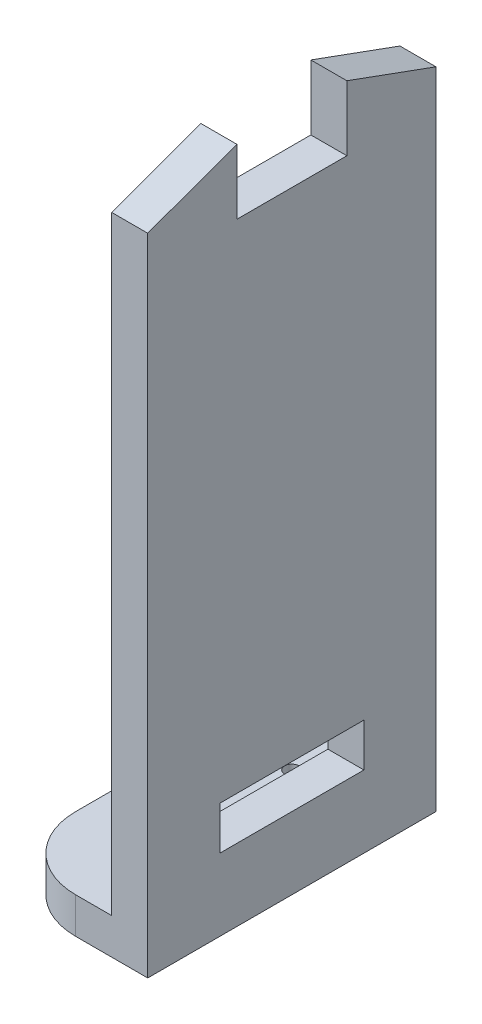
ISO-10303-21;
HEADER;
FILE_DESCRIPTION(('STEP AP214'),'2;1');
FILE_NAME('part.step','',(''),(''),'','','');
FILE_SCHEMA(('AUTOMOTIVE_DESIGN { 1 0 10303 214 1 1 1 1 }'));
ENDSEC;
DATA;
#1=APPLICATION_CONTEXT('core data for automotive mechanical design processes');
#2=APPLICATION_PROTOCOL_DEFINITION('international standard','automotive_design',2000,#1);
#3=PRODUCT_CONTEXT('',#1,'mechanical');
#4=PRODUCT('Part','Part','',(#3));
#5=PRODUCT_RELATED_PRODUCT_CATEGORY('part','',(#4));
#6=PRODUCT_DEFINITION_FORMATION('','',#4);
#7=PRODUCT_DEFINITION_CONTEXT('part definition',#1,'design');
#8=PRODUCT_DEFINITION('design','',#6,#7);
#9=PRODUCT_DEFINITION_SHAPE('','',#8);
#10=(LENGTH_UNIT() NAMED_UNIT(*) SI_UNIT(.MILLI.,.METRE.));
#11=(NAMED_UNIT(*) PLANE_ANGLE_UNIT() SI_UNIT($,.RADIAN.));
#12=(NAMED_UNIT(*) SI_UNIT($,.STERADIAN.) SOLID_ANGLE_UNIT());
#13=UNCERTAINTY_MEASURE_WITH_UNIT(LENGTH_MEASURE(1.E-05),#10,'distance_accuracy_value','');
#14=(GEOMETRIC_REPRESENTATION_CONTEXT(3) GLOBAL_UNCERTAINTY_ASSIGNED_CONTEXT((#13)) GLOBAL_UNIT_ASSIGNED_CONTEXT((#10,
#11,#12)) REPRESENTATION_CONTEXT('',''));
#15=CARTESIAN_POINT('',(0.,0.,0.));
#16=DIRECTION('',(0.,0.,1.));
#17=DIRECTION('',(1.,0.,0.));
#18=AXIS2_PLACEMENT_3D('',#15,#16,#17);
#19=CARTESIAN_POINT('',(3.93641699992273,5.,8.02072626814005));
#20=DIRECTION('',(-1.,0.,0.));
#21=DIRECTION('',(0.,0.,1.));
#22=AXIS2_PLACEMENT_3D('',#19,#20,#21);
#23=PLANE('',#22);
#24=DIRECTION('',(0.,0.,-1.));
#25=VECTOR('',#24,1.);
#26=CARTESIAN_POINT('',(3.93641699992273,0.,8.02072626814005));
#27=LINE('',#26,#25);
#28=CARTESIAN_POINT('',(3.93641699992273,0.,8.02072626814005));
#29=VERTEX_POINT('',#28);
#30=CARTESIAN_POINT('',(3.93641699992275,0.,-31.97927373186));
#31=VERTEX_POINT('',#30);
#32=EDGE_CURVE('E269',#29,#31,#27,.T.);
#33=ORIENTED_EDGE('',*,*,#32,.T.);
#34=DIRECTION('',(0.,-1.,0.));
#35=VECTOR('',#34,1.);
#36=CARTESIAN_POINT('',(3.93641699992275,5.,-31.97927373186));
#37=LINE('',#36,#35);
#38=CARTESIAN_POINT('',(3.93641699992275,89.5077910597415,-31.97927373186));
#39=VERTEX_POINT('',#38);
#40=EDGE_CURVE('E284',#39,#31,#37,.T.);
#41=ORIENTED_EDGE('',*,*,#40,.F.);
#42=DIRECTION('',(0.,0.342471678133721,0.939528152678925));
#43=VECTOR('',#42,1.);
#44=CARTESIAN_POINT('',(3.93641699992275,89.5077910597415,-31.97927373186));
#45=LINE('',#44,#43);
#46=CARTESIAN_POINT('',(3.93641699992274,94.015582119483,-19.6127135827085));
#47=VERTEX_POINT('',#46);
#48=EDGE_CURVE('E182',#39,#47,#45,.T.);
#49=ORIENTED_EDGE('',*,*,#48,.T.);
#50=DIRECTION('',(0.,-1.,0.));
#51=VECTOR('',#50,1.);
#52=CARTESIAN_POINT('',(3.93641699992274,94.015582119483,-19.6127135827085));
#53=LINE('',#52,#51);
#54=CARTESIAN_POINT('',(3.93641699992274,85.,-19.6127135827085));
#55=VERTEX_POINT('',#54);
#56=EDGE_CURVE('E214',#47,#55,#53,.T.);
#57=ORIENTED_EDGE('',*,*,#56,.T.);
#58=DIRECTION('',(0.,0.,1.));
#59=VECTOR('',#58,1.);
#60=CARTESIAN_POINT('',(3.93641699992274,85.,-19.6127135827085));
#61=LINE('',#60,#59);
#62=CARTESIAN_POINT('',(3.93641699992274,85.,-4.34583388101135));
#63=VERTEX_POINT('',#62);
#64=EDGE_CURVE('E217',#55,#63,#61,.T.);
#65=ORIENTED_EDGE('',*,*,#64,.T.);
#66=DIRECTION('',(0.,1.,0.));
#67=VECTOR('',#66,1.);
#68=CARTESIAN_POINT('',(3.93641699992274,85.,-4.34583388101135));
#69=LINE('',#68,#67);
#70=CARTESIAN_POINT('',(3.93641699992274,94.015582119483,-4.34583388101135));
#71=VERTEX_POINT('',#70);
#72=EDGE_CURVE('E220',#63,#71,#69,.T.);
#73=ORIENTED_EDGE('',*,*,#72,.T.);
#74=DIRECTION('',(0.,-0.342471678133721,0.939528152678925));
#75=VECTOR('',#74,1.);
#76=CARTESIAN_POINT('',(3.93641699992274,94.015582119483,-4.34583388101135));
#77=LINE('',#76,#75);
#78=CARTESIAN_POINT('',(3.93641699992273,89.5077910597415,8.02072626814005));
#79=VERTEX_POINT('',#78);
#80=EDGE_CURVE('E190',#71,#79,#77,.T.);
#81=ORIENTED_EDGE('',*,*,#80,.T.);
#82=DIRECTION('',(0.,-1.,0.));
#83=VECTOR('',#82,1.);
#84=CARTESIAN_POINT('',(3.93641699992273,5.,8.02072626814005));
#85=LINE('',#84,#83);
#86=EDGE_CURVE('E45',#79,#29,#85,.T.);
#87=ORIENTED_EDGE('',*,*,#86,.T.);
#88=EDGE_LOOP('',(#33,#41,#49,#57,#65,#73,#81,#87));
#89=FACE_BOUND('',#88,.T.);
#90=DIRECTION('',(0.,0.,1.));
#91=VECTOR('',#90,1.);
#92=CARTESIAN_POINT('',(3.93641699992274,16.,0.));
#93=LINE('',#92,#91);
#94=CARTESIAN_POINT('',(3.93641699992274,16.,-21.9792737318599));
#95=VERTEX_POINT('',#94);
#96=CARTESIAN_POINT('',(3.93641699992274,16.,-1.97927373186003));
#97=VERTEX_POINT('',#96);
#98=EDGE_CURVE('E153',#95,#97,#93,.T.);
#99=ORIENTED_EDGE('',*,*,#98,.F.);
#100=DIRECTION('',(0.,-1.,0.));
#101=VECTOR('',#100,1.);
#102=CARTESIAN_POINT('',(3.93641699992274,0.,-21.9792737318599));
#103=LINE('',#102,#101);
#104=CARTESIAN_POINT('',(3.93641699992274,10.,-21.9792737318599));
#105=VERTEX_POINT('',#104);
#106=EDGE_CURVE('E162',#95,#105,#103,.T.);
#107=ORIENTED_EDGE('',*,*,#106,.T.);
#108=DIRECTION('',(0.,0.,1.));
#109=VECTOR('',#108,1.);
#110=CARTESIAN_POINT('',(3.93641699992274,10.,0.));
#111=LINE('',#110,#109);
#112=CARTESIAN_POINT('',(3.93641699992274,10.,-1.97927373186003));
#113=VERTEX_POINT('',#112);
#114=EDGE_CURVE('E52',#105,#113,#111,.T.);
#115=ORIENTED_EDGE('',*,*,#114,.T.);
#116=DIRECTION('',(0.,-1.,0.));
#117=VECTOR('',#116,1.);
#118=CARTESIAN_POINT('',(3.93641699992274,0.,-1.97927373186003));
#119=LINE('',#118,#117);
#120=EDGE_CURVE('E159',#97,#113,#119,.T.);
#121=ORIENTED_EDGE('',*,*,#120,.F.);
#122=EDGE_LOOP('',(#99,#107,#115,#121));
#123=FACE_BOUND('',#122,.T.);
#124=ADVANCED_FACE('F37',(#89,#123),#23,.F.);
#125=CARTESIAN_POINT('',(-1.06358300007726,0.,0.));
#126=DIRECTION('',(1.,0.,0.));
#127=DIRECTION('',(0.,0.,-1.));
#128=AXIS2_PLACEMENT_3D('',#125,#126,#127);
#129=PLANE('',#128);
#130=DIRECTION('',(0.,-1.,0.));
#131=VECTOR('',#130,1.);
#132=CARTESIAN_POINT('',(-1.06358300007727,89.5077910597415,8.02072626814005));
#133=LINE('',#132,#131);
#134=CARTESIAN_POINT('',(-1.06358300007727,89.5077910597415,8.02072626814005));
#135=VERTEX_POINT('',#134);
#136=CARTESIAN_POINT('',(-1.06358300007727,5.,8.02072626814005));
#137=VERTEX_POINT('',#136);
#138=EDGE_CURVE('E186',#135,#137,#133,.T.);
#139=ORIENTED_EDGE('',*,*,#138,.F.);
#140=DIRECTION('',(0.,-0.342471678133721,0.939528152678925));
#141=VECTOR('',#140,1.);
#142=CARTESIAN_POINT('',(-1.06358300007726,94.015582119483,-4.34583388101135));
#143=LINE('',#142,#141);
#144=CARTESIAN_POINT('',(-1.06358300007726,94.015582119483,-4.34583388101135));
#145=VERTEX_POINT('',#144);
#146=EDGE_CURVE('E208',#145,#135,#143,.T.);
#147=ORIENTED_EDGE('',*,*,#146,.F.);
#148=DIRECTION('',(0.,1.,0.));
#149=VECTOR('',#148,1.);
#150=CARTESIAN_POINT('',(-1.06358300007726,85.,-4.34583388101135));
#151=LINE('',#150,#149);
#152=CARTESIAN_POINT('',(-1.06358300007726,85.,-4.34583388101135));
#153=VERTEX_POINT('',#152);
#154=EDGE_CURVE('E205',#153,#145,#151,.T.);
#155=ORIENTED_EDGE('',*,*,#154,.F.);
#156=DIRECTION('',(0.,0.,1.));
#157=VECTOR('',#156,1.);
#158=CARTESIAN_POINT('',(-1.06358300007726,85.,-19.6127135827085));
#159=LINE('',#158,#157);
#160=CARTESIAN_POINT('',(-1.06358300007726,85.,-19.6127135827085));
#161=VERTEX_POINT('',#160);
#162=EDGE_CURVE('E202',#161,#153,#159,.T.);
#163=ORIENTED_EDGE('',*,*,#162,.F.);
#164=DIRECTION('',(0.,-1.,0.));
#165=VECTOR('',#164,1.);
#166=CARTESIAN_POINT('',(-1.06358300007726,94.015582119483,-19.6127135827085));
#167=LINE('',#166,#165);
#168=CARTESIAN_POINT('',(-1.06358300007726,94.015582119483,-19.6127135827085));
#169=VERTEX_POINT('',#168);
#170=EDGE_CURVE('E199',#169,#161,#167,.T.);
#171=ORIENTED_EDGE('',*,*,#170,.F.);
#172=DIRECTION('',(0.,0.342471678133721,0.939528152678925));
#173=VECTOR('',#172,1.);
#174=CARTESIAN_POINT('',(-1.06358300007725,89.5077910597415,-31.97927373186));
#175=LINE('',#174,#173);
#176=CARTESIAN_POINT('',(-1.06358300007725,89.5077910597415,-31.97927373186));
#177=VERTEX_POINT('',#176);
#178=EDGE_CURVE('E196',#177,#169,#175,.T.);
#179=ORIENTED_EDGE('',*,*,#178,.F.);
#180=DIRECTION('',(0.,1.,0.));
#181=VECTOR('',#180,1.);
#182=CARTESIAN_POINT('',(-1.06358300007725,5.,-31.97927373186));
#183=LINE('',#182,#181);
#184=CARTESIAN_POINT('',(-1.06358300007726,5.,-31.97927373186));
#185=VERTEX_POINT('',#184);
#186=EDGE_CURVE('E193',#185,#177,#183,.T.);
#187=ORIENTED_EDGE('',*,*,#186,.F.);
#188=DIRECTION('',(0.,0.,-1.));
#189=VECTOR('',#188,1.);
#190=CARTESIAN_POINT('',(-1.06358300007727,5.,8.02072626814005));
#191=LINE('',#190,#189);
#192=EDGE_CURVE('E189',#137,#185,#191,.T.);
#193=ORIENTED_EDGE('',*,*,#192,.F.);
#194=EDGE_LOOP('',(#139,#147,#155,#163,#171,#179,#187,#193));
#195=FACE_BOUND('',#194,.T.);
#196=DIRECTION('',(0.,0.,1.));
#197=VECTOR('',#196,1.);
#198=CARTESIAN_POINT('',(-1.06358300007726,16.,0.));
#199=LINE('',#198,#197);
#200=CARTESIAN_POINT('',(-1.06358300007726,16.,-21.9792737318599));
#201=VERTEX_POINT('',#200);
#202=CARTESIAN_POINT('',(-1.06358300007726,16.,-1.97927373186003));
#203=VERTEX_POINT('',#202);
#204=EDGE_CURVE('E60',#201,#203,#199,.T.);
#205=ORIENTED_EDGE('',*,*,#204,.T.);
#206=DIRECTION('',(0.,-1.,0.));
#207=VECTOR('',#206,1.);
#208=CARTESIAN_POINT('',(-1.06358300007726,0.,-1.97927373186003));
#209=LINE('',#208,#207);
#210=CARTESIAN_POINT('',(-1.06358300007726,10.,-1.97927373186003));
#211=VERTEX_POINT('',#210);
#212=EDGE_CURVE('E167',#203,#211,#209,.T.);
#213=ORIENTED_EDGE('',*,*,#212,.T.);
#214=DIRECTION('',(0.,0.,1.));
#215=VECTOR('',#214,1.);
#216=CARTESIAN_POINT('',(-1.06358300007726,10.,0.));
#217=LINE('',#216,#215);
#218=CARTESIAN_POINT('',(-1.06358300007726,10.,-21.9792737318599));
#219=VERTEX_POINT('',#218);
#220=EDGE_CURVE('E170',#219,#211,#217,.T.);
#221=ORIENTED_EDGE('',*,*,#220,.F.);
#222=DIRECTION('',(0.,-1.,0.));
#223=VECTOR('',#222,1.);
#224=CARTESIAN_POINT('',(-1.06358300007726,0.,-21.9792737318599));
#225=LINE('',#224,#223);
#226=EDGE_CURVE('E176',#201,#219,#225,.T.);
#227=ORIENTED_EDGE('',*,*,#226,.F.);
#228=EDGE_LOOP('',(#205,#213,#221,#227));
#229=FACE_BOUND('',#228,.T.);
#230=ADVANCED_FACE('F314',(#195,#229),#129,.F.);
#231=CARTESIAN_POINT('',(-6.06358300007726,5.,-1.97927373185994));
#232=DIRECTION('',(0.,1.,0.));
#233=DIRECTION('',(0.,0.,1.));
#234=AXIS2_PLACEMENT_3D('',#231,#232,#233);
#235=PLANE('',#234);
#236=CARTESIAN_POINT('',(-6.06358300007726,5.,-21.9792737318599));
#237=DIRECTION('',(0.,1.,0.));
#238=DIRECTION('',(0.,0.,1.));
#239=AXIS2_PLACEMENT_3D('',#236,#237,#238);
#240=CIRCLE('',#239,1.);
#241=CARTESIAN_POINT('',(-6.06358300007726,5.,-20.9792737318599));
#242=VERTEX_POINT('',#241);
#243=EDGE_CURVE('E245',#242,#242,#240,.T.);
#244=ORIENTED_EDGE('',*,*,#243,.F.);
#245=EDGE_LOOP('',(#244));
#246=FACE_BOUND('',#245,.T.);
#247=CARTESIAN_POINT('',(-6.06358300007726,5.,-1.97927373185994));
#248=DIRECTION('',(0.,1.,0.));
#249=DIRECTION('',(0.,0.,1.));
#250=AXIS2_PLACEMENT_3D('',#247,#248,#249);
#251=CIRCLE('',#250,1.);
#252=CARTESIAN_POINT('',(-6.06358300007726,5.,-0.979273731859943));
#253=VERTEX_POINT('',#252);
#254=EDGE_CURVE('E239',#253,#253,#251,.T.);
#255=ORIENTED_EDGE('',*,*,#254,.F.);
#256=EDGE_LOOP('',(#255));
#257=FACE_BOUND('',#256,.T.);
#258=DIRECTION('',(1.,0.,0.));
#259=VECTOR('',#258,1.);
#260=CARTESIAN_POINT('',(-6.06358300007718,5.,8.02072626814005));
#261=LINE('',#260,#259);
#262=CARTESIAN_POINT('',(-6.06358300007718,5.,8.02072626814005));
#263=VERTEX_POINT('',#262);
#264=EDGE_CURVE('E254',#263,#137,#261,.T.);
#265=ORIENTED_EDGE('',*,*,#264,.T.);
#266=ORIENTED_EDGE('',*,*,#192,.T.);
#267=DIRECTION('',(-1.,0.,0.));
#268=VECTOR('',#267,1.);
#269=CARTESIAN_POINT('',(3.93641699992275,5.,-31.97927373186));
#270=LINE('',#269,#268);
#271=CARTESIAN_POINT('',(-6.06358300007718,5.,-31.97927373186));
#272=VERTEX_POINT('',#271);
#273=EDGE_CURVE('E258',#185,#272,#270,.T.);
#274=ORIENTED_EDGE('',*,*,#273,.T.);
#275=CARTESIAN_POINT('',(-6.06358300007726,5.,-21.9792737318599));
#276=DIRECTION('',(0.,1.,0.));
#277=DIRECTION('',(0.,0.,1.));
#278=AXIS2_PLACEMENT_3D('',#275,#276,#277);
#279=CIRCLE('',#278,10.);
#280=CARTESIAN_POINT('',(-16.0635830000773,5.,-21.9792737318599));
#281=VERTEX_POINT('',#280);
#282=EDGE_CURVE('E260',#272,#281,#279,.T.);
#283=ORIENTED_EDGE('',*,*,#282,.T.);
#284=DIRECTION('',(0.,0.,1.));
#285=VECTOR('',#284,1.);
#286=CARTESIAN_POINT('',(-16.0635830000773,5.,-21.9792737318599));
#287=LINE('',#286,#285);
#288=CARTESIAN_POINT('',(-16.0635830000773,5.,-1.97927373186002));
#289=VERTEX_POINT('',#288);
#290=EDGE_CURVE('E262',#281,#289,#287,.T.);
#291=ORIENTED_EDGE('',*,*,#290,.T.);
#292=CARTESIAN_POINT('',(-6.06358300007726,5.,-1.97927373185994));
#293=DIRECTION('',(0.,1.,0.));
#294=DIRECTION('',(0.,0.,1.));
#295=AXIS2_PLACEMENT_3D('',#292,#293,#294);
#296=CIRCLE('',#295,10.);
#297=EDGE_CURVE('E251',#289,#263,#296,.T.);
#298=ORIENTED_EDGE('',*,*,#297,.T.);
#299=EDGE_LOOP('',(#265,#266,#274,#283,#291,#298));
#300=FACE_BOUND('',#299,.T.);
#301=ADVANCED_FACE('F308',(#246,#257,#300),#235,.T.);
#302=CARTESIAN_POINT('',(-6.06358300007726,0.,-1.97927373185994));
#303=DIRECTION('',(0.,1.,0.));
#304=DIRECTION('',(0.,0.,1.));
#305=AXIS2_PLACEMENT_3D('',#302,#303,#304);
#306=PLANE('',#305);
#307=CARTESIAN_POINT('',(-6.06358300007726,0.,-1.97927373185994));
#308=DIRECTION('',(0.,1.,0.));
#309=DIRECTION('',(0.,0.,1.));
#310=AXIS2_PLACEMENT_3D('',#307,#308,#309);
#311=CIRCLE('',#310,10.);
#312=CARTESIAN_POINT('',(-16.0635830000773,0.,-1.97927373186002));
#313=VERTEX_POINT('',#312);
#314=CARTESIAN_POINT('',(-6.06358300007718,0.,8.02072626814005));
#315=VERTEX_POINT('',#314);
#316=EDGE_CURVE('E248',#313,#315,#311,.T.);
#317=ORIENTED_EDGE('',*,*,#316,.F.);
#318=DIRECTION('',(0.,0.,1.));
#319=VECTOR('',#318,1.);
#320=CARTESIAN_POINT('',(-16.0635830000773,0.,-21.9792737318599));
#321=LINE('',#320,#319);
#322=CARTESIAN_POINT('',(-16.0635830000773,0.,-21.9792737318599));
#323=VERTEX_POINT('',#322);
#324=EDGE_CURVE('E255',#323,#313,#321,.T.);
#325=ORIENTED_EDGE('',*,*,#324,.F.);
#326=CARTESIAN_POINT('',(-6.06358300007726,0.,-21.9792737318599));
#327=DIRECTION('',(0.,1.,0.));
#328=DIRECTION('',(0.,0.,1.));
#329=AXIS2_PLACEMENT_3D('',#326,#327,#328);
#330=CIRCLE('',#329,10.);
#331=CARTESIAN_POINT('',(-6.06358300007718,0.,-31.97927373186));
#332=VERTEX_POINT('',#331);
#333=EDGE_CURVE('E273',#332,#323,#330,.T.);
#334=ORIENTED_EDGE('',*,*,#333,.F.);
#335=DIRECTION('',(-1.,0.,0.));
#336=VECTOR('',#335,1.);
#337=CARTESIAN_POINT('',(3.93641699992275,0.,-31.97927373186));
#338=LINE('',#337,#336);
#339=EDGE_CURVE('E271',#31,#332,#338,.T.);
#340=ORIENTED_EDGE('',*,*,#339,.F.);
#341=ORIENTED_EDGE('',*,*,#32,.F.);
#342=DIRECTION('',(1.,0.,0.));
#343=VECTOR('',#342,1.);
#344=CARTESIAN_POINT('',(-6.06358300007718,0.,8.02072626814005));
#345=LINE('',#344,#343);
#346=EDGE_CURVE('E267',#315,#29,#345,.T.);
#347=ORIENTED_EDGE('',*,*,#346,.F.);
#348=EDGE_LOOP('',(#317,#325,#334,#340,#341,#347));
#349=FACE_BOUND('',#348,.T.);
#350=CARTESIAN_POINT('',(-6.06358300007726,0.,-21.9792737318599));
#351=DIRECTION('',(0.,1.,0.));
#352=DIRECTION('',(0.,0.,1.));
#353=AXIS2_PLACEMENT_3D('',#350,#351,#352);
#354=CIRCLE('',#353,1.);
#355=CARTESIAN_POINT('',(-6.06358300007726,0.,-20.9792737318599));
#356=VERTEX_POINT('',#355);
#357=EDGE_CURVE('E242',#356,#356,#354,.T.);
#358=ORIENTED_EDGE('',*,*,#357,.T.);
#359=EDGE_LOOP('',(#358));
#360=FACE_BOUND('',#359,.T.);
#361=CARTESIAN_POINT('',(-6.06358300007726,0.,-1.97927373185994));
#362=DIRECTION('',(0.,1.,0.));
#363=DIRECTION('',(0.,0.,1.));
#364=AXIS2_PLACEMENT_3D('',#361,#362,#363);
#365=CIRCLE('',#364,1.);
#366=CARTESIAN_POINT('',(-6.06358300007726,0.,-0.979273731859943));
#367=VERTEX_POINT('',#366);
#368=EDGE_CURVE('E228',#367,#367,#365,.T.);
#369=ORIENTED_EDGE('',*,*,#368,.T.);
#370=EDGE_LOOP('',(#369));
#371=FACE_BOUND('',#370,.T.);
#372=ADVANCED_FACE('F294',(#349,#360,#371),#306,.F.);
#373=CARTESIAN_POINT('',(-6.06358300007726,5.,-1.97927373185994));
#374=DIRECTION('',(0.,-1.,0.));
#375=DIRECTION('',(0.,0.,-1.));
#376=AXIS2_PLACEMENT_3D('',#373,#374,#375);
#377=CYLINDRICAL_SURFACE('',#376,10.);
#378=ORIENTED_EDGE('',*,*,#316,.T.);
#379=DIRECTION('',(0.,-1.,0.));
#380=VECTOR('',#379,1.);
#381=CARTESIAN_POINT('',(-6.06358300007718,5.,8.02072626814005));
#382=LINE('',#381,#380);
#383=EDGE_CURVE('E11',#263,#315,#382,.T.);
#384=ORIENTED_EDGE('',*,*,#383,.F.);
#385=ORIENTED_EDGE('',*,*,#297,.F.);
#386=DIRECTION('',(0.,-1.,0.));
#387=VECTOR('',#386,1.);
#388=CARTESIAN_POINT('',(-16.0635830000773,5.,-1.97927373186002));
#389=LINE('',#388,#387);
#390=EDGE_CURVE('E264',#289,#313,#389,.T.);
#391=ORIENTED_EDGE('',*,*,#390,.T.);
#392=EDGE_LOOP('',(#378,#384,#385,#391));
#393=FACE_BOUND('',#392,.T.);
#394=ADVANCED_FACE('F39',(#393),#377,.T.);
#395=CARTESIAN_POINT('',(-6.06358300007718,5.,8.02072626814005));
#396=DIRECTION('',(0.,0.,-1.));
#397=DIRECTION('',(-1.,0.,0.));
#398=AXIS2_PLACEMENT_3D('',#395,#396,#397);
#399=PLANE('',#398);
#400=ORIENTED_EDGE('',*,*,#346,.T.);
#401=ORIENTED_EDGE('',*,*,#86,.F.);
#402=DIRECTION('',(1.,0.,0.));
#403=VECTOR('',#402,1.);
#404=CARTESIAN_POINT('',(-1.06358300007727,89.5077910597415,8.02072626814005));
#405=LINE('',#404,#403);
#406=EDGE_CURVE('E225',#135,#79,#405,.T.);
#407=ORIENTED_EDGE('',*,*,#406,.F.);
#408=ORIENTED_EDGE('',*,*,#138,.T.);
#409=ORIENTED_EDGE('',*,*,#264,.F.);
#410=ORIENTED_EDGE('',*,*,#383,.T.);
#411=EDGE_LOOP('',(#400,#401,#407,#408,#409,#410));
#412=FACE_BOUND('',#411,.T.);
#413=ADVANCED_FACE('F333',(#412),#399,.F.);
#414=CARTESIAN_POINT('',(3.93641699992275,5.,-31.97927373186));
#415=DIRECTION('',(0.,0.,1.));
#416=DIRECTION('',(1.,0.,0.));
#417=AXIS2_PLACEMENT_3D('',#414,#415,#416);
#418=PLANE('',#417);
#419=ORIENTED_EDGE('',*,*,#339,.T.);
#420=DIRECTION('',(0.,-1.,0.));
#421=VECTOR('',#420,1.);
#422=CARTESIAN_POINT('',(-6.06358300007718,5.,-31.97927373186));
#423=LINE('',#422,#421);
#424=EDGE_CURVE('E281',#272,#332,#423,.T.);
#425=ORIENTED_EDGE('',*,*,#424,.F.);
#426=ORIENTED_EDGE('',*,*,#273,.F.);
#427=ORIENTED_EDGE('',*,*,#186,.T.);
#428=DIRECTION('',(1.,0.,0.));
#429=VECTOR('',#428,1.);
#430=CARTESIAN_POINT('',(-1.06358300007725,89.5077910597415,-31.97927373186));
#431=LINE('',#430,#429);
#432=EDGE_CURVE('E211',#177,#39,#431,.T.);
#433=ORIENTED_EDGE('',*,*,#432,.T.);
#434=ORIENTED_EDGE('',*,*,#40,.T.);
#435=EDGE_LOOP('',(#419,#425,#426,#427,#433,#434));
#436=FACE_BOUND('',#435,.T.);
#437=ADVANCED_FACE('F300',(#436),#418,.F.);
#438=CARTESIAN_POINT('',(-6.06358300007726,5.,-21.9792737318599));
#439=DIRECTION('',(0.,-1.,0.));
#440=DIRECTION('',(0.,0.,-1.));
#441=AXIS2_PLACEMENT_3D('',#438,#439,#440);
#442=CYLINDRICAL_SURFACE('',#441,10.);
#443=ORIENTED_EDGE('',*,*,#333,.T.);
#444=DIRECTION('',(0.,-1.,0.));
#445=VECTOR('',#444,1.);
#446=CARTESIAN_POINT('',(-16.0635830000773,5.,-21.9792737318599));
#447=LINE('',#446,#445);
#448=EDGE_CURVE('E278',#281,#323,#447,.T.);
#449=ORIENTED_EDGE('',*,*,#448,.F.);
#450=ORIENTED_EDGE('',*,*,#282,.F.);
#451=ORIENTED_EDGE('',*,*,#424,.T.);
#452=EDGE_LOOP('',(#443,#449,#450,#451));
#453=FACE_BOUND('',#452,.T.);
#454=ADVANCED_FACE('F304',(#453),#442,.T.);
#455=CARTESIAN_POINT('',(-16.0635830000773,5.,-21.9792737318599));
#456=DIRECTION('',(1.,0.,0.));
#457=DIRECTION('',(0.,0.,-1.));
#458=AXIS2_PLACEMENT_3D('',#455,#456,#457);
#459=PLANE('',#458);
#460=ORIENTED_EDGE('',*,*,#324,.T.);
#461=ORIENTED_EDGE('',*,*,#390,.F.);
#462=ORIENTED_EDGE('',*,*,#290,.F.);
#463=ORIENTED_EDGE('',*,*,#448,.T.);
#464=EDGE_LOOP('',(#460,#461,#462,#463));
#465=FACE_BOUND('',#464,.T.);
#466=ADVANCED_FACE('F338',(#465),#459,.F.);
#467=CARTESIAN_POINT('',(-6.06358300007726,5.,-21.9792737318599));
#468=DIRECTION('',(0.,-1.,0.));
#469=DIRECTION('',(0.,0.,-1.));
#470=AXIS2_PLACEMENT_3D('',#467,#468,#469);
#471=CYLINDRICAL_SURFACE('',#470,1.);
#472=ORIENTED_EDGE('',*,*,#243,.T.);
#473=EDGE_LOOP('',(#472));
#474=FACE_BOUND('',#473,.T.);
#475=ORIENTED_EDGE('',*,*,#357,.F.);
#476=EDGE_LOOP('',(#475));
#477=FACE_BOUND('',#476,.T.);
#478=ADVANCED_FACE('F340',(#474,#477),#471,.F.);
#479=CARTESIAN_POINT('',(-6.06358300007726,5.,-1.97927373185994));
#480=DIRECTION('',(0.,-1.,0.));
#481=DIRECTION('',(0.,0.,-1.));
#482=AXIS2_PLACEMENT_3D('',#479,#480,#481);
#483=CYLINDRICAL_SURFACE('',#482,1.);
#484=ORIENTED_EDGE('',*,*,#254,.T.);
#485=EDGE_LOOP('',(#484));
#486=FACE_BOUND('',#485,.T.);
#487=ORIENTED_EDGE('',*,*,#368,.F.);
#488=EDGE_LOOP('',(#487));
#489=FACE_BOUND('',#488,.T.);
#490=ADVANCED_FACE('F346',(#486,#489),#483,.F.);
#491=CARTESIAN_POINT('',(-1.06358300007726,94.015582119483,-4.34583388101135));
#492=DIRECTION('',(0.,0.939528152678925,0.342471678133721));
#493=DIRECTION('',(0.,-0.342471678133721,0.939528152678925));
#494=AXIS2_PLACEMENT_3D('',#491,#492,#493);
#495=PLANE('',#494);
#496=ORIENTED_EDGE('',*,*,#80,.F.);
#497=DIRECTION('',(1.,0.,0.));
#498=VECTOR('',#497,1.);
#499=CARTESIAN_POINT('',(-1.06358300007726,94.015582119483,-4.34583388101135));
#500=LINE('',#499,#498);
#501=EDGE_CURVE('E229',#145,#71,#500,.T.);
#502=ORIENTED_EDGE('',*,*,#501,.F.);
#503=ORIENTED_EDGE('',*,*,#146,.T.);
#504=ORIENTED_EDGE('',*,*,#406,.T.);
#505=EDGE_LOOP('',(#496,#502,#503,#504));
#506=FACE_BOUND('',#505,.T.);
#507=ADVANCED_FACE('F331',(#506),#495,.T.);
#508=CARTESIAN_POINT('',(-1.06358300007726,85.,-4.34583388101135));
#509=DIRECTION('',(0.,0.,-1.));
#510=DIRECTION('',(-1.,0.,0.));
#511=AXIS2_PLACEMENT_3D('',#508,#509,#510);
#512=PLANE('',#511);
#513=ORIENTED_EDGE('',*,*,#72,.F.);
#514=DIRECTION('',(1.,0.,0.));
#515=VECTOR('',#514,1.);
#516=CARTESIAN_POINT('',(-1.06358300007726,85.,-4.34583388101135));
#517=LINE('',#516,#515);
#518=EDGE_CURVE('E231',#153,#63,#517,.T.);
#519=ORIENTED_EDGE('',*,*,#518,.F.);
#520=ORIENTED_EDGE('',*,*,#154,.T.);
#521=ORIENTED_EDGE('',*,*,#501,.T.);
#522=EDGE_LOOP('',(#513,#519,#520,#521));
#523=FACE_BOUND('',#522,.T.);
#524=ADVANCED_FACE('F329',(#523),#512,.T.);
#525=CARTESIAN_POINT('',(-1.06358300007726,85.,-19.6127135827085));
#526=DIRECTION('',(0.,1.,0.));
#527=DIRECTION('',(0.,0.,1.));
#528=AXIS2_PLACEMENT_3D('',#525,#526,#527);
#529=PLANE('',#528);
#530=ORIENTED_EDGE('',*,*,#64,.F.);
#531=DIRECTION('',(1.,0.,0.));
#532=VECTOR('',#531,1.);
#533=CARTESIAN_POINT('',(-1.06358300007726,85.,-19.6127135827085));
#534=LINE('',#533,#532);
#535=EDGE_CURVE('E233',#161,#55,#534,.T.);
#536=ORIENTED_EDGE('',*,*,#535,.F.);
#537=ORIENTED_EDGE('',*,*,#162,.T.);
#538=ORIENTED_EDGE('',*,*,#518,.T.);
#539=EDGE_LOOP('',(#530,#536,#537,#538));
#540=FACE_BOUND('',#539,.T.);
#541=ADVANCED_FACE('F325',(#540),#529,.T.);
#542=CARTESIAN_POINT('',(-1.06358300007726,94.015582119483,-19.6127135827085));
#543=DIRECTION('',(0.,0.,1.));
#544=DIRECTION('',(1.,0.,0.));
#545=AXIS2_PLACEMENT_3D('',#542,#543,#544);
#546=PLANE('',#545);
#547=ORIENTED_EDGE('',*,*,#56,.F.);
#548=DIRECTION('',(1.,0.,0.));
#549=VECTOR('',#548,1.);
#550=CARTESIAN_POINT('',(-1.06358300007726,94.015582119483,-19.6127135827085));
#551=LINE('',#550,#549);
#552=EDGE_CURVE('E235',#169,#47,#551,.T.);
#553=ORIENTED_EDGE('',*,*,#552,.F.);
#554=ORIENTED_EDGE('',*,*,#170,.T.);
#555=ORIENTED_EDGE('',*,*,#535,.T.);
#556=EDGE_LOOP('',(#547,#553,#554,#555));
#557=FACE_BOUND('',#556,.T.);
#558=ADVANCED_FACE('F323',(#557),#546,.T.);
#559=CARTESIAN_POINT('',(-1.06358300007725,89.5077910597415,-31.97927373186));
#560=DIRECTION('',(0.,0.939528152678925,-0.342471678133721));
#561=DIRECTION('',(0.,0.342471678133721,0.939528152678925));
#562=AXIS2_PLACEMENT_3D('',#559,#560,#561);
#563=PLANE('',#562);
#564=ORIENTED_EDGE('',*,*,#48,.F.);
#565=ORIENTED_EDGE('',*,*,#432,.F.);
#566=ORIENTED_EDGE('',*,*,#178,.T.);
#567=ORIENTED_EDGE('',*,*,#552,.T.);
#568=EDGE_LOOP('',(#564,#565,#566,#567));
#569=FACE_BOUND('',#568,.T.);
#570=ADVANCED_FACE('F319',(#569),#563,.T.);
#571=CARTESIAN_POINT('',(3.93641699992274,16.,0.));
#572=DIRECTION('',(0.,-1.,0.));
#573=DIRECTION('',(0.,0.,-1.));
#574=AXIS2_PLACEMENT_3D('',#571,#572,#573);
#575=PLANE('',#574);
#576=ORIENTED_EDGE('',*,*,#204,.F.);
#577=DIRECTION('',(-1.,0.,0.));
#578=VECTOR('',#577,1.);
#579=CARTESIAN_POINT('',(3.93641699992274,16.,-21.9792737318599));
#580=LINE('',#579,#578);
#581=EDGE_CURVE('E149',#95,#201,#580,.T.);
#582=ORIENTED_EDGE('',*,*,#581,.F.);
#583=ORIENTED_EDGE('',*,*,#98,.T.);
#584=DIRECTION('',(-1.,0.,0.));
#585=VECTOR('',#584,1.);
#586=CARTESIAN_POINT('',(3.93641699992274,16.,-1.97927373186003));
#587=LINE('',#586,#585);
#588=EDGE_CURVE('E180',#97,#203,#587,.T.);
#589=ORIENTED_EDGE('',*,*,#588,.T.);
#590=EDGE_LOOP('',(#576,#582,#583,#589));
#591=FACE_BOUND('',#590,.T.);
#592=ADVANCED_FACE('F151',(#591),#575,.T.);
#593=CARTESIAN_POINT('',(3.93641699992274,0.,-1.97927373186003));
#594=DIRECTION('',(0.,0.,-1.));
#595=DIRECTION('',(-1.,0.,0.));
#596=AXIS2_PLACEMENT_3D('',#593,#594,#595);
#597=PLANE('',#596);
#598=ORIENTED_EDGE('',*,*,#212,.F.);
#599=ORIENTED_EDGE('',*,*,#588,.F.);
#600=ORIENTED_EDGE('',*,*,#120,.T.);
#601=DIRECTION('',(-1.,0.,0.));
#602=VECTOR('',#601,1.);
#603=CARTESIAN_POINT('',(3.93641699992274,10.,-1.97927373186003));
#604=LINE('',#603,#602);
#605=EDGE_CURVE('E183',#113,#211,#604,.T.);
#606=ORIENTED_EDGE('',*,*,#605,.T.);
#607=EDGE_LOOP('',(#598,#599,#600,#606));
#608=FACE_BOUND('',#607,.T.);
#609=ADVANCED_FACE('F387',(#608),#597,.T.);
#610=CARTESIAN_POINT('',(3.93641699992274,10.,0.));
#611=DIRECTION('',(0.,-1.,0.));
#612=DIRECTION('',(0.,0.,-1.));
#613=AXIS2_PLACEMENT_3D('',#610,#611,#612);
#614=PLANE('',#613);
#615=ORIENTED_EDGE('',*,*,#220,.T.);
#616=ORIENTED_EDGE('',*,*,#605,.F.);
#617=ORIENTED_EDGE('',*,*,#114,.F.);
#618=DIRECTION('',(-1.,0.,0.));
#619=VECTOR('',#618,1.);
#620=CARTESIAN_POINT('',(3.93641699992274,10.,-21.9792737318599));
#621=LINE('',#620,#619);
#622=EDGE_CURVE('E158',#105,#219,#621,.T.);
#623=ORIENTED_EDGE('',*,*,#622,.T.);
#624=EDGE_LOOP('',(#615,#616,#617,#623));
#625=FACE_BOUND('',#624,.T.);
#626=ADVANCED_FACE('F390',(#625),#614,.F.);
#627=CARTESIAN_POINT('',(3.93641699992274,0.,-21.9792737318599));
#628=DIRECTION('',(0.,0.,-1.));
#629=DIRECTION('',(-1.,0.,0.));
#630=AXIS2_PLACEMENT_3D('',#627,#628,#629);
#631=PLANE('',#630);
#632=ORIENTED_EDGE('',*,*,#226,.T.);
#633=ORIENTED_EDGE('',*,*,#622,.F.);
#634=ORIENTED_EDGE('',*,*,#106,.F.);
#635=ORIENTED_EDGE('',*,*,#581,.T.);
#636=EDGE_LOOP('',(#632,#633,#634,#635));
#637=FACE_BOUND('',#636,.T.);
#638=ADVANCED_FACE('F163',(#637),#631,.F.);
#639=CLOSED_SHELL('',(#124,#230,#301,#372,#394,#413,#437,#454,#466,#478,#490,#507,#524,#541,
#558,#570,#592,#609,#626,#638));
#640=MANIFOLD_SOLID_BREP('B2',#639);
#641=ADVANCED_BREP_SHAPE_REPRESENTATION('',(#18,#640),#14);
#642=SHAPE_DEFINITION_REPRESENTATION(#9,#641);
ENDSEC;
END-ISO-10303-21;
